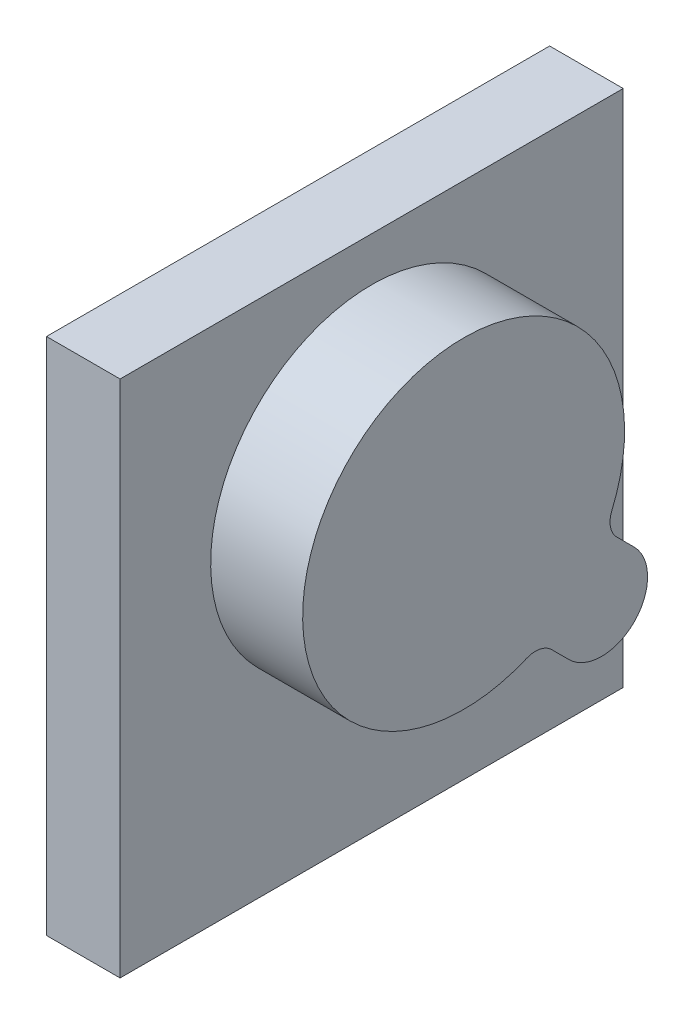
ISO-10303-21;
HEADER;
FILE_DESCRIPTION(('STEP AP214'),'2;1');
FILE_NAME('part.step','',(''),(''),'','','');
FILE_SCHEMA(('AUTOMOTIVE_DESIGN { 1 0 10303 214 1 1 1 1 }'));
ENDSEC;
DATA;
#1=APPLICATION_CONTEXT('core data for automotive mechanical design processes');
#2=APPLICATION_PROTOCOL_DEFINITION('international standard','automotive_design',2000,#1);
#3=PRODUCT_CONTEXT('',#1,'mechanical');
#4=PRODUCT('Part','Part','',(#3));
#5=PRODUCT_RELATED_PRODUCT_CATEGORY('part','',(#4));
#6=PRODUCT_DEFINITION_FORMATION('','',#4);
#7=PRODUCT_DEFINITION_CONTEXT('part definition',#1,'design');
#8=PRODUCT_DEFINITION('design','',#6,#7);
#9=PRODUCT_DEFINITION_SHAPE('','',#8);
#10=(LENGTH_UNIT() NAMED_UNIT(*) SI_UNIT(.MILLI.,.METRE.));
#11=(NAMED_UNIT(*) PLANE_ANGLE_UNIT() SI_UNIT($,.RADIAN.));
#12=(NAMED_UNIT(*) SI_UNIT($,.STERADIAN.) SOLID_ANGLE_UNIT());
#13=UNCERTAINTY_MEASURE_WITH_UNIT(LENGTH_MEASURE(1.E-05),#10,'distance_accuracy_value','');
#14=(GEOMETRIC_REPRESENTATION_CONTEXT(3) GLOBAL_UNCERTAINTY_ASSIGNED_CONTEXT((#13)) GLOBAL_UNIT_ASSIGNED_CONTEXT((#10,
#11,#12)) REPRESENTATION_CONTEXT('',''));
#15=CARTESIAN_POINT('',(0.,0.,0.));
#16=DIRECTION('',(0.,0.,1.));
#17=DIRECTION('',(1.,0.,0.));
#18=AXIS2_PLACEMENT_3D('',#15,#16,#17);
#19=CARTESIAN_POINT('',(0.,-71.628,69.469));
#20=DIRECTION('',(-1.,0.,0.));
#21=DIRECTION('',(0.,0.,1.));
#22=AXIS2_PLACEMENT_3D('',#19,#20,#21);
#23=PLANE('',#22);
#24=DIRECTION('',(0.,-1.,0.));
#25=VECTOR('',#24,1.);
#26=CARTESIAN_POINT('',(0.,71.628,69.469));
#27=LINE('',#26,#25);
#28=CARTESIAN_POINT('',(0.,71.628,69.469));
#29=VERTEX_POINT('',#28);
#30=CARTESIAN_POINT('',(0.,-71.628,69.469));
#31=VERTEX_POINT('',#30);
#32=EDGE_CURVE('E143',#29,#31,#27,.T.);
#33=ORIENTED_EDGE('',*,*,#32,.T.);
#34=DIRECTION('',(0.,0.,-1.));
#35=VECTOR('',#34,1.);
#36=CARTESIAN_POINT('',(0.,-71.628,-69.469));
#37=LINE('',#36,#35);
#38=CARTESIAN_POINT('',(0.,-71.628,-69.469));
#39=VERTEX_POINT('',#38);
#40=EDGE_CURVE('E146',#31,#39,#37,.T.);
#41=ORIENTED_EDGE('',*,*,#40,.T.);
#42=DIRECTION('',(0.,1.,0.));
#43=VECTOR('',#42,1.);
#44=CARTESIAN_POINT('',(0.,71.628,-69.469));
#45=LINE('',#44,#43);
#46=CARTESIAN_POINT('',(0.,71.628,-69.469));
#47=VERTEX_POINT('',#46);
#48=EDGE_CURVE('E164',#39,#47,#45,.T.);
#49=ORIENTED_EDGE('',*,*,#48,.T.);
#50=DIRECTION('',(0.,0.,1.));
#51=VECTOR('',#50,1.);
#52=CARTESIAN_POINT('',(0.,71.628,-69.469));
#53=LINE('',#52,#51);
#54=EDGE_CURVE('E155',#47,#29,#53,.T.);
#55=ORIENTED_EDGE('',*,*,#54,.T.);
#56=EDGE_LOOP('',(#33,#41,#49,#55));
#57=FACE_BOUND('',#56,.T.);
#58=DIRECTION('',(0.,0.707106781186549,0.707106781186546));
#59=VECTOR('',#58,1.);
#60=CARTESIAN_POINT('',(0.,-61.2098889263243,-94.1564011684625));
#61=LINE('',#60,#59);
#62=CARTESIAN_POINT('',(0.,-14.1337438789308,-47.0802561210691));
#63=VERTEX_POINT('',#62);
#64=CARTESIAN_POINT('',(0.,-9.33342480833315,-42.2799370504715));
#65=VERTEX_POINT('',#64);
#66=EDGE_CURVE('E141',#63,#65,#61,.T.);
#67=ORIENTED_EDGE('',*,*,#66,.F.);
#68=CARTESIAN_POINT('',(0.,-23.114,-38.1));
#69=DIRECTION('',(1.,0.,0.));
#70=DIRECTION('',(0.,0.,-1.));
#71=AXIS2_PLACEMENT_3D('',#68,#69,#70);
#72=CIRCLE('',#71,12.7);
#73=CARTESIAN_POINT('',(0.,-32.0942561210691,-29.1197438789308));
#74=VERTEX_POINT('',#73);
#75=EDGE_CURVE('E137',#63,#74,#72,.F.);
#76=ORIENTED_EDGE('',*,*,#75,.T.);
#77=DIRECTION('',(0.,0.707106781186548,0.707106781186547));
#78=VECTOR('',#77,1.);
#79=CARTESIAN_POINT('',(0.,-79.1704011684626,-76.1958889263243));
#80=LINE('',#79,#78);
#81=CARTESIAN_POINT('',(0.,-27.2939370504715,-24.3194248083332));
#82=VERTEX_POINT('',#81);
#83=EDGE_CURVE('E50',#74,#82,#80,.T.);
#84=ORIENTED_EDGE('',*,*,#83,.T.);
#85=CARTESIAN_POINT('',(0.,-31.784065111006,-19.8292967477986));
#86=DIRECTION('',(1.,0.,0.));
#87=DIRECTION('',(0.,0.,-1.));
#88=AXIS2_PLACEMENT_3D('',#85,#86,#87);
#89=CIRCLE('',#88,6.35);
#90=CARTESIAN_POINT('',(0.,-25.9378069721303,-17.3506346543237));
#91=VERTEX_POINT('',#90);
#92=EDGE_CURVE('E293',#82,#91,#89,.T.);
#93=ORIENTED_EDGE('',*,*,#92,.T.);
#94=CARTESIAN_POINT('',(0.,14.986,0.));
#95=DIRECTION('',(1.,0.,0.));
#96=DIRECTION('',(0.,0.,-1.));
#97=AXIS2_PLACEMENT_3D('',#94,#95,#96);
#98=CIRCLE('',#97,44.45);
#99=CARTESIAN_POINT('',(0.,-2.36463465432375,-40.9238069721303));
#100=VERTEX_POINT('',#99);
#101=EDGE_CURVE('E286',#100,#91,#98,.T.);
#102=ORIENTED_EDGE('',*,*,#101,.F.);
#103=CARTESIAN_POINT('',(0.,-4.84329674779857,-46.770065111006));
#104=DIRECTION('',(1.,0.,0.));
#105=DIRECTION('',(0.,0.,-1.));
#106=AXIS2_PLACEMENT_3D('',#103,#104,#105);
#107=CIRCLE('',#106,6.35);
#108=EDGE_CURVE('E284',#65,#100,#107,.F.);
#109=ORIENTED_EDGE('',*,*,#108,.F.);
#110=EDGE_LOOP('',(#67,#76,#84,#93,#102,#109));
#111=FACE_BOUND('',#110,.T.);
#112=ADVANCED_FACE('F33',(#57,#111),#23,.F.);
#113=CARTESIAN_POINT('',(-20.32,71.628,69.469));
#114=DIRECTION('',(0.,0.,1.));
#115=DIRECTION('',(0.,-1.,0.));
#116=AXIS2_PLACEMENT_3D('',#113,#114,#115);
#117=PLANE('',#116);
#118=ORIENTED_EDGE('',*,*,#32,.F.);
#119=DIRECTION('',(1.,0.,0.));
#120=VECTOR('',#119,1.);
#121=CARTESIAN_POINT('',(-20.32,71.628,69.469));
#122=LINE('',#121,#120);
#123=CARTESIAN_POINT('',(-20.32,71.628,69.469));
#124=VERTEX_POINT('',#123);
#125=EDGE_CURVE('E11',#124,#29,#122,.T.);
#126=ORIENTED_EDGE('',*,*,#125,.F.);
#127=DIRECTION('',(0.,-1.,0.));
#128=VECTOR('',#127,1.);
#129=CARTESIAN_POINT('',(-20.32,71.628,69.469));
#130=LINE('',#129,#128);
#131=CARTESIAN_POINT('',(-20.32,-71.628,69.469));
#132=VERTEX_POINT('',#131);
#133=EDGE_CURVE('E152',#124,#132,#130,.T.);
#134=ORIENTED_EDGE('',*,*,#133,.T.);
#135=DIRECTION('',(1.,0.,0.));
#136=VECTOR('',#135,1.);
#137=CARTESIAN_POINT('',(-20.32,-71.628,69.469));
#138=LINE('',#137,#136);
#139=EDGE_CURVE('E37',#132,#31,#138,.T.);
#140=ORIENTED_EDGE('',*,*,#139,.T.);
#141=EDGE_LOOP('',(#118,#126,#134,#140));
#142=FACE_BOUND('',#141,.T.);
#143=ADVANCED_FACE('F35',(#142),#117,.T.);
#144=CARTESIAN_POINT('',(-20.32,71.628,-69.469));
#145=DIRECTION('',(0.,1.,0.));
#146=DIRECTION('',(0.,0.,1.));
#147=AXIS2_PLACEMENT_3D('',#144,#145,#146);
#148=PLANE('',#147);
#149=ORIENTED_EDGE('',*,*,#54,.F.);
#150=DIRECTION('',(1.,0.,0.));
#151=VECTOR('',#150,1.);
#152=CARTESIAN_POINT('',(-20.32,71.628,-69.469));
#153=LINE('',#152,#151);
#154=CARTESIAN_POINT('',(-20.32,71.628,-69.469));
#155=VERTEX_POINT('',#154);
#156=EDGE_CURVE('E42',#155,#47,#153,.T.);
#157=ORIENTED_EDGE('',*,*,#156,.F.);
#158=DIRECTION('',(0.,0.,1.));
#159=VECTOR('',#158,1.);
#160=CARTESIAN_POINT('',(-20.32,71.628,-69.469));
#161=LINE('',#160,#159);
#162=EDGE_CURVE('E160',#155,#124,#161,.T.);
#163=ORIENTED_EDGE('',*,*,#162,.T.);
#164=ORIENTED_EDGE('',*,*,#125,.T.);
#165=EDGE_LOOP('',(#149,#157,#163,#164));
#166=FACE_BOUND('',#165,.T.);
#167=ADVANCED_FACE('F174',(#166),#148,.T.);
#168=CARTESIAN_POINT('',(-20.32,71.628,-69.469));
#169=DIRECTION('',(0.,0.,-1.));
#170=DIRECTION('',(0.,1.,0.));
#171=AXIS2_PLACEMENT_3D('',#168,#169,#170);
#172=PLANE('',#171);
#173=ORIENTED_EDGE('',*,*,#48,.F.);
#174=DIRECTION('',(1.,0.,0.));
#175=VECTOR('',#174,1.);
#176=CARTESIAN_POINT('',(-20.32,-71.628,-69.469));
#177=LINE('',#176,#175);
#178=CARTESIAN_POINT('',(-20.32,-71.628,-69.469));
#179=VERTEX_POINT('',#178);
#180=EDGE_CURVE('E169',#179,#39,#177,.T.);
#181=ORIENTED_EDGE('',*,*,#180,.F.);
#182=DIRECTION('',(0.,1.,0.));
#183=VECTOR('',#182,1.);
#184=CARTESIAN_POINT('',(-20.32,71.628,-69.469));
#185=LINE('',#184,#183);
#186=EDGE_CURVE('E157',#179,#155,#185,.T.);
#187=ORIENTED_EDGE('',*,*,#186,.T.);
#188=ORIENTED_EDGE('',*,*,#156,.T.);
#189=EDGE_LOOP('',(#173,#181,#187,#188));
#190=FACE_BOUND('',#189,.T.);
#191=ADVANCED_FACE('F178',(#190),#172,.T.);
#192=CARTESIAN_POINT('',(-20.32,-71.628,-69.469));
#193=DIRECTION('',(0.,-1.,0.));
#194=DIRECTION('',(0.,0.,-1.));
#195=AXIS2_PLACEMENT_3D('',#192,#193,#194);
#196=PLANE('',#195);
#197=ORIENTED_EDGE('',*,*,#40,.F.);
#198=ORIENTED_EDGE('',*,*,#139,.F.);
#199=DIRECTION('',(0.,0.,-1.));
#200=VECTOR('',#199,1.);
#201=CARTESIAN_POINT('',(-20.32,-71.628,-69.469));
#202=LINE('',#201,#200);
#203=EDGE_CURVE('E154',#132,#179,#202,.T.);
#204=ORIENTED_EDGE('',*,*,#203,.T.);
#205=ORIENTED_EDGE('',*,*,#180,.T.);
#206=EDGE_LOOP('',(#197,#198,#204,#205));
#207=FACE_BOUND('',#206,.T.);
#208=ADVANCED_FACE('F171',(#207),#196,.T.);
#209=CARTESIAN_POINT('',(-20.32,-71.628,69.469));
#210=DIRECTION('',(-1.,0.,0.));
#211=DIRECTION('',(0.,0.,1.));
#212=AXIS2_PLACEMENT_3D('',#209,#210,#211);
#213=PLANE('',#212);
#214=ORIENTED_EDGE('',*,*,#133,.F.);
#215=ORIENTED_EDGE('',*,*,#162,.F.);
#216=ORIENTED_EDGE('',*,*,#186,.F.);
#217=ORIENTED_EDGE('',*,*,#203,.F.);
#218=EDGE_LOOP('',(#214,#215,#216,#217));
#219=FACE_BOUND('',#218,.T.);
#220=ADVANCED_FACE('F180',(#219),#213,.T.);
#221=CARTESIAN_POINT('',(25.4,-61.2098889263243,-94.1564011684625));
#222=DIRECTION('',(0.,-0.707106781186546,0.707106781186549));
#223=DIRECTION('',(0.,-0.707106781186549,-0.707106781186546));
#224=AXIS2_PLACEMENT_3D('',#221,#222,#223);
#225=PLANE('',#224);
#226=ORIENTED_EDGE('',*,*,#66,.T.);
#227=DIRECTION('',(-1.,0.,0.));
#228=VECTOR('',#227,1.);
#229=CARTESIAN_POINT('',(25.4,-9.33342480833315,-42.2799370504715));
#230=LINE('',#229,#228);
#231=CARTESIAN_POINT('',(25.4,-9.33342480833315,-42.2799370504715));
#232=VERTEX_POINT('',#231);
#233=EDGE_CURVE('E121',#232,#65,#230,.T.);
#234=ORIENTED_EDGE('',*,*,#233,.F.);
#235=DIRECTION('',(0.,0.707106781186549,0.707106781186546));
#236=VECTOR('',#235,1.);
#237=CARTESIAN_POINT('',(25.4,-61.2098889263243,-94.1564011684625));
#238=LINE('',#237,#236);
#239=CARTESIAN_POINT('',(25.4,-14.1337438789308,-47.0802561210691));
#240=VERTEX_POINT('',#239);
#241=EDGE_CURVE('E128',#240,#232,#238,.T.);
#242=ORIENTED_EDGE('',*,*,#241,.F.);
#243=DIRECTION('',(-1.,0.,0.));
#244=VECTOR('',#243,1.);
#245=CARTESIAN_POINT('',(25.4,-14.1337438789308,-47.0802561210691));
#246=LINE('',#245,#244);
#247=EDGE_CURVE('E280',#240,#63,#246,.T.);
#248=ORIENTED_EDGE('',*,*,#247,.T.);
#249=EDGE_LOOP('',(#226,#234,#242,#248));
#250=FACE_BOUND('',#249,.T.);
#251=ADVANCED_FACE('F139',(#250),#225,.F.);
#252=CARTESIAN_POINT('',(25.4,-4.84329674779857,-46.770065111006));
#253=DIRECTION('',(-1.,0.,0.));
#254=DIRECTION('',(0.,0.,1.));
#255=AXIS2_PLACEMENT_3D('',#252,#253,#254);
#256=CYLINDRICAL_SURFACE('',#255,6.35);
#257=ORIENTED_EDGE('',*,*,#108,.T.);
#258=DIRECTION('',(-1.,0.,0.));
#259=VECTOR('',#258,1.);
#260=CARTESIAN_POINT('',(25.4,-2.36463465432375,-40.9238069721303));
#261=LINE('',#260,#259);
#262=CARTESIAN_POINT('',(25.4,-2.36463465432375,-40.9238069721303));
#263=VERTEX_POINT('',#262);
#264=EDGE_CURVE('E124',#263,#100,#261,.T.);
#265=ORIENTED_EDGE('',*,*,#264,.F.);
#266=CARTESIAN_POINT('',(25.4,-4.84329674779857,-46.770065111006));
#267=DIRECTION('',(1.,0.,0.));
#268=DIRECTION('',(0.,0.,-1.));
#269=AXIS2_PLACEMENT_3D('',#266,#267,#268);
#270=CIRCLE('',#269,6.35);
#271=EDGE_CURVE('E117',#232,#263,#270,.F.);
#272=ORIENTED_EDGE('',*,*,#271,.F.);
#273=ORIENTED_EDGE('',*,*,#233,.T.);
#274=EDGE_LOOP('',(#257,#265,#272,#273));
#275=FACE_BOUND('',#274,.T.);
#276=ADVANCED_FACE('F119',(#275),#256,.F.);
#277=CARTESIAN_POINT('',(25.4,14.986,0.));
#278=DIRECTION('',(-1.,0.,0.));
#279=DIRECTION('',(0.,0.,1.));
#280=AXIS2_PLACEMENT_3D('',#277,#278,#279);
#281=CYLINDRICAL_SURFACE('',#280,44.45);
#282=ORIENTED_EDGE('',*,*,#101,.T.);
#283=DIRECTION('',(-1.,0.,0.));
#284=VECTOR('',#283,1.);
#285=CARTESIAN_POINT('',(25.4,-25.9378069721303,-17.3506346543237));
#286=LINE('',#285,#284);
#287=CARTESIAN_POINT('',(25.4,-25.9378069721303,-17.3506346543237));
#288=VERTEX_POINT('',#287);
#289=EDGE_CURVE('E148',#288,#91,#286,.T.);
#290=ORIENTED_EDGE('',*,*,#289,.F.);
#291=CARTESIAN_POINT('',(25.4,14.986,0.));
#292=DIRECTION('',(1.,0.,0.));
#293=DIRECTION('',(0.,0.,-1.));
#294=AXIS2_PLACEMENT_3D('',#291,#292,#293);
#295=CIRCLE('',#294,44.45);
#296=EDGE_CURVE('E127',#263,#288,#295,.T.);
#297=ORIENTED_EDGE('',*,*,#296,.F.);
#298=ORIENTED_EDGE('',*,*,#264,.T.);
#299=EDGE_LOOP('',(#282,#290,#297,#298));
#300=FACE_BOUND('',#299,.T.);
#301=ADVANCED_FACE('F228',(#300),#281,.T.);
#302=CARTESIAN_POINT('',(25.4,-31.784065111006,-19.8292967477986));
#303=DIRECTION('',(-1.,0.,0.));
#304=DIRECTION('',(0.,0.,1.));
#305=AXIS2_PLACEMENT_3D('',#302,#303,#304);
#306=CYLINDRICAL_SURFACE('',#305,6.35);
#307=ORIENTED_EDGE('',*,*,#92,.F.);
#308=DIRECTION('',(-1.,0.,0.));
#309=VECTOR('',#308,1.);
#310=CARTESIAN_POINT('',(25.4,-27.2939370504715,-24.3194248083332));
#311=LINE('',#310,#309);
#312=CARTESIAN_POINT('',(25.4,-27.2939370504715,-24.3194248083332));
#313=VERTEX_POINT('',#312);
#314=EDGE_CURVE('E299',#313,#82,#311,.T.);
#315=ORIENTED_EDGE('',*,*,#314,.F.);
#316=CARTESIAN_POINT('',(25.4,-31.784065111006,-19.8292967477986));
#317=DIRECTION('',(1.,0.,0.));
#318=DIRECTION('',(0.,0.,-1.));
#319=AXIS2_PLACEMENT_3D('',#316,#317,#318);
#320=CIRCLE('',#319,6.35);
#321=EDGE_CURVE('E304',#313,#288,#320,.T.);
#322=ORIENTED_EDGE('',*,*,#321,.T.);
#323=ORIENTED_EDGE('',*,*,#289,.T.);
#324=EDGE_LOOP('',(#307,#315,#322,#323));
#325=FACE_BOUND('',#324,.T.);
#326=ADVANCED_FACE('F237',(#325),#306,.F.);
#327=CARTESIAN_POINT('',(25.4,-79.1704011684626,-76.1958889263243));
#328=DIRECTION('',(0.,-0.707106781186547,0.707106781186548));
#329=DIRECTION('',(0.,-0.707106781186548,-0.707106781186547));
#330=AXIS2_PLACEMENT_3D('',#327,#328,#329);
#331=PLANE('',#330);
#332=ORIENTED_EDGE('',*,*,#83,.F.);
#333=DIRECTION('',(-1.,0.,0.));
#334=VECTOR('',#333,1.);
#335=CARTESIAN_POINT('',(25.4,-32.0942561210691,-29.1197438789308));
#336=LINE('',#335,#334);
#337=CARTESIAN_POINT('',(25.4,-32.0942561210691,-29.1197438789308));
#338=VERTEX_POINT('',#337);
#339=EDGE_CURVE('E281',#338,#74,#336,.T.);
#340=ORIENTED_EDGE('',*,*,#339,.F.);
#341=DIRECTION('',(0.,0.707106781186548,0.707106781186547));
#342=VECTOR('',#341,1.);
#343=CARTESIAN_POINT('',(25.4,-79.1704011684626,-76.1958889263243));
#344=LINE('',#343,#342);
#345=EDGE_CURVE('E306',#338,#313,#344,.T.);
#346=ORIENTED_EDGE('',*,*,#345,.T.);
#347=ORIENTED_EDGE('',*,*,#314,.T.);
#348=EDGE_LOOP('',(#332,#340,#346,#347));
#349=FACE_BOUND('',#348,.T.);
#350=ADVANCED_FACE('F247',(#349),#331,.T.);
#351=CARTESIAN_POINT('',(25.4,-23.114,-38.1));
#352=DIRECTION('',(-1.,0.,0.));
#353=DIRECTION('',(0.,0.,1.));
#354=AXIS2_PLACEMENT_3D('',#351,#352,#353);
#355=CYLINDRICAL_SURFACE('',#354,12.7);
#356=ORIENTED_EDGE('',*,*,#75,.F.);
#357=ORIENTED_EDGE('',*,*,#247,.F.);
#358=CARTESIAN_POINT('',(25.4,-23.114,-38.1));
#359=DIRECTION('',(1.,0.,0.));
#360=DIRECTION('',(0.,0.,-1.));
#361=AXIS2_PLACEMENT_3D('',#358,#359,#360);
#362=CIRCLE('',#361,12.7);
#363=EDGE_CURVE('E135',#240,#338,#362,.F.);
#364=ORIENTED_EDGE('',*,*,#363,.T.);
#365=ORIENTED_EDGE('',*,*,#339,.T.);
#366=EDGE_LOOP('',(#356,#357,#364,#365));
#367=FACE_BOUND('',#366,.T.);
#368=ADVANCED_FACE('F257',(#367),#355,.T.);
#369=CARTESIAN_POINT('',(25.4,0.,-155.366290094787));
#370=DIRECTION('',(1.,0.,0.));
#371=DIRECTION('',(0.,0.,-1.));
#372=AXIS2_PLACEMENT_3D('',#369,#370,#371);
#373=PLANE('',#372);
#374=ORIENTED_EDGE('',*,*,#241,.T.);
#375=ORIENTED_EDGE('',*,*,#271,.T.);
#376=ORIENTED_EDGE('',*,*,#296,.T.);
#377=ORIENTED_EDGE('',*,*,#321,.F.);
#378=ORIENTED_EDGE('',*,*,#345,.F.);
#379=ORIENTED_EDGE('',*,*,#363,.F.);
#380=EDGE_LOOP('',(#374,#375,#376,#377,#378,#379));
#381=FACE_BOUND('',#380,.T.);
#382=ADVANCED_FACE('F132',(#381),#373,.T.);
#383=CLOSED_SHELL('',(#112,#143,#167,#191,#208,#220,#251,#276,#301,#326,#350,#368,#382));
#384=MANIFOLD_SOLID_BREP('B2',#383);
#385=ADVANCED_BREP_SHAPE_REPRESENTATION('',(#18,#384),#14);
#386=SHAPE_DEFINITION_REPRESENTATION(#9,#385);
ENDSEC;
END-ISO-10303-21;
